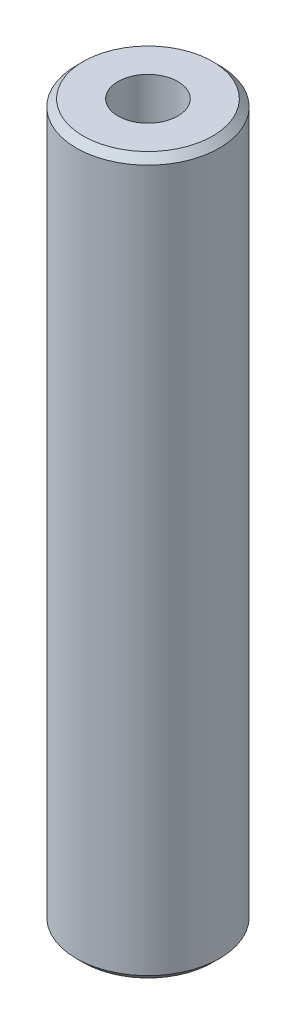
ISO-10303-21;
HEADER;
FILE_DESCRIPTION(('STEP AP214'),'2;1');
FILE_NAME('part.step','',(''),(''),'','','');
FILE_SCHEMA(('AUTOMOTIVE_DESIGN { 1 0 10303 214 1 1 1 1 }'));
ENDSEC;
DATA;
#1=APPLICATION_CONTEXT('core data for automotive mechanical design processes');
#2=APPLICATION_PROTOCOL_DEFINITION('international standard','automotive_design',2000,#1);
#3=PRODUCT_CONTEXT('',#1,'mechanical');
#4=PRODUCT('Part','Part','',(#3));
#5=PRODUCT_RELATED_PRODUCT_CATEGORY('part','',(#4));
#6=PRODUCT_DEFINITION_FORMATION('','',#4);
#7=PRODUCT_DEFINITION_CONTEXT('part definition',#1,'design');
#8=PRODUCT_DEFINITION('design','',#6,#7);
#9=PRODUCT_DEFINITION_SHAPE('','',#8);
#10=(LENGTH_UNIT() NAMED_UNIT(*) SI_UNIT(.MILLI.,.METRE.));
#11=(NAMED_UNIT(*) PLANE_ANGLE_UNIT() SI_UNIT($,.RADIAN.));
#12=(NAMED_UNIT(*) SI_UNIT($,.STERADIAN.) SOLID_ANGLE_UNIT());
#13=UNCERTAINTY_MEASURE_WITH_UNIT(LENGTH_MEASURE(1.E-05),#10,'distance_accuracy_value','');
#14=(GEOMETRIC_REPRESENTATION_CONTEXT(3) GLOBAL_UNCERTAINTY_ASSIGNED_CONTEXT((#13)) GLOBAL_UNIT_ASSIGNED_CONTEXT((#10,
#11,#12)) REPRESENTATION_CONTEXT('',''));
#15=CARTESIAN_POINT('',(0.,0.,0.));
#16=DIRECTION('',(0.,0.,1.));
#17=DIRECTION('',(1.,0.,0.));
#18=AXIS2_PLACEMENT_3D('',#15,#16,#17);
#19=CARTESIAN_POINT('',(0.,600.,0.));
#20=DIRECTION('',(0.,-1.,0.));
#21=DIRECTION('',(0.,0.,-1.));
#22=AXIS2_PLACEMENT_3D('',#19,#20,#21);
#23=CYLINDRICAL_SURFACE('',#22,60.);
#24=CARTESIAN_POINT('',(0.,594.189680264105,0.));
#25=DIRECTION('',(0.,1.,0.));
#26=DIRECTION('',(0.,0.,1.));
#27=AXIS2_PLACEMENT_3D('',#24,#25,#26);
#28=CIRCLE('',#27,60.);
#29=CARTESIAN_POINT('',(0.,594.189680264105,60.));
#30=VERTEX_POINT('',#29);
#31=EDGE_CURVE('E50',#30,#30,#28,.F.);
#32=ORIENTED_EDGE('',*,*,#31,.T.);
#33=EDGE_LOOP('',(#32));
#34=FACE_BOUND('',#33,.T.);
#35=CARTESIAN_POINT('',(0.,5.81031973589485,0.));
#36=DIRECTION('',(0.,1.,0.));
#37=DIRECTION('',(0.,0.,1.));
#38=AXIS2_PLACEMENT_3D('',#35,#36,#37);
#39=CIRCLE('',#38,60.);
#40=CARTESIAN_POINT('',(0.,5.81031973589485,60.));
#41=VERTEX_POINT('',#40);
#42=EDGE_CURVE('E51',#41,#41,#39,.T.);
#43=ORIENTED_EDGE('',*,*,#42,.T.);
#44=EDGE_LOOP('',(#43));
#45=FACE_BOUND('',#44,.T.);
#46=ADVANCED_FACE('F39',(#34,#45),#23,.T.);
#47=CARTESIAN_POINT('',(0.,600.,0.));
#48=DIRECTION('',(0.,1.,0.));
#49=DIRECTION('',(0.,0.,1.));
#50=AXIS2_PLACEMENT_3D('',#47,#48,#49);
#51=PLANE('',#50);
#52=CARTESIAN_POINT('',(0.,600.,0.));
#53=DIRECTION('',(0.,1.,0.));
#54=DIRECTION('',(0.,0.,1.));
#55=AXIS2_PLACEMENT_3D('',#52,#53,#54);
#56=CIRCLE('',#55,54.1896802641048);
#57=CARTESIAN_POINT('',(0.,600.,54.1896802641048));
#58=VERTEX_POINT('',#57);
#59=EDGE_CURVE('E54',#58,#58,#56,.T.);
#60=ORIENTED_EDGE('',*,*,#59,.T.);
#61=EDGE_LOOP('',(#60));
#62=FACE_BOUND('',#61,.T.);
#63=CARTESIAN_POINT('',(0.,600.,0.));
#64=DIRECTION('',(0.,1.,0.));
#65=DIRECTION('',(0.,0.,1.));
#66=AXIS2_PLACEMENT_3D('',#63,#64,#65);
#67=CIRCLE('',#66,25.0959392827166);
#68=CARTESIAN_POINT('',(0.,600.,25.0959392827166));
#69=VERTEX_POINT('',#68);
#70=EDGE_CURVE('E58',#69,#69,#67,.T.);
#71=ORIENTED_EDGE('',*,*,#70,.F.);
#72=EDGE_LOOP('',(#71));
#73=FACE_BOUND('',#72,.T.);
#74=ADVANCED_FACE('F69',(#62,#73),#51,.T.);
#75=CARTESIAN_POINT('',(0.,0.,0.));
#76=DIRECTION('',(0.,1.,0.));
#77=DIRECTION('',(0.,0.,1.));
#78=AXIS2_PLACEMENT_3D('',#75,#76,#77);
#79=PLANE('',#78);
#80=CARTESIAN_POINT('',(0.,0.,0.));
#81=DIRECTION('',(0.,1.,0.));
#82=DIRECTION('',(0.,0.,1.));
#83=AXIS2_PLACEMENT_3D('',#80,#81,#82);
#84=CIRCLE('',#83,54.1896802641051);
#85=CARTESIAN_POINT('',(0.,0.,54.1896802641051));
#86=VERTEX_POINT('',#85);
#87=EDGE_CURVE('E10',#86,#86,#84,.F.);
#88=ORIENTED_EDGE('',*,*,#87,.T.);
#89=EDGE_LOOP('',(#88));
#90=FACE_BOUND('',#89,.T.);
#91=CARTESIAN_POINT('',(0.,0.,0.));
#92=DIRECTION('',(0.,1.,0.));
#93=DIRECTION('',(0.,0.,1.));
#94=AXIS2_PLACEMENT_3D('',#91,#92,#93);
#95=CIRCLE('',#94,25.0959392827166);
#96=CARTESIAN_POINT('',(0.,0.,25.0959392827166));
#97=VERTEX_POINT('',#96);
#98=EDGE_CURVE('E63',#97,#97,#95,.T.);
#99=ORIENTED_EDGE('',*,*,#98,.T.);
#100=EDGE_LOOP('',(#99));
#101=FACE_BOUND('',#100,.T.);
#102=ADVANCED_FACE('F75',(#90,#101),#79,.F.);
#103=CARTESIAN_POINT('',(0.,600.,0.));
#104=DIRECTION('',(0.,-1.,0.));
#105=DIRECTION('',(0.,0.,-1.));
#106=AXIS2_PLACEMENT_3D('',#103,#104,#105);
#107=CYLINDRICAL_SURFACE('',#106,25.0959392827166);
#108=ORIENTED_EDGE('',*,*,#70,.T.);
#109=EDGE_LOOP('',(#108));
#110=FACE_BOUND('',#109,.T.);
#111=ORIENTED_EDGE('',*,*,#98,.F.);
#112=EDGE_LOOP('',(#111));
#113=FACE_BOUND('',#112,.T.);
#114=ADVANCED_FACE('F70',(#110,#113),#107,.F.);
#115=CARTESIAN_POINT('',(0.,600.,0.));
#116=DIRECTION('',(0.,-1.,0.));
#117=DIRECTION('',(0.,0.,-1.));
#118=AXIS2_PLACEMENT_3D('',#115,#116,#117);
#119=CONICAL_SURFACE('',#118,54.1896802641048,0.785398163397453);
#120=ORIENTED_EDGE('',*,*,#31,.F.);
#121=EDGE_LOOP('',(#120));
#122=FACE_BOUND('',#121,.T.);
#123=ORIENTED_EDGE('',*,*,#59,.F.);
#124=EDGE_LOOP('',(#123));
#125=FACE_BOUND('',#124,.T.);
#126=ADVANCED_FACE('F81',(#122,#125),#119,.T.);
#127=CARTESIAN_POINT('',(0.,5.81031973589485,0.));
#128=DIRECTION('',(0.,1.,0.));
#129=DIRECTION('',(0.,0.,1.));
#130=AXIS2_PLACEMENT_3D('',#127,#128,#129);
#131=CONICAL_SURFACE('',#130,60.,0.785398163397453);
#132=ORIENTED_EDGE('',*,*,#87,.F.);
#133=EDGE_LOOP('',(#132));
#134=FACE_BOUND('',#133,.T.);
#135=ORIENTED_EDGE('',*,*,#42,.F.);
#136=EDGE_LOOP('',(#135));
#137=FACE_BOUND('',#136,.T.);
#138=ADVANCED_FACE('F45',(#134,#137),#131,.T.);
#139=CLOSED_SHELL('',(#46,#74,#102,#114,#126,#138));
#140=MANIFOLD_SOLID_BREP('B2',#139);
#141=ADVANCED_BREP_SHAPE_REPRESENTATION('',(#18,#140),#14);
#142=SHAPE_DEFINITION_REPRESENTATION(#9,#141);
ENDSEC;
END-ISO-10303-21;
